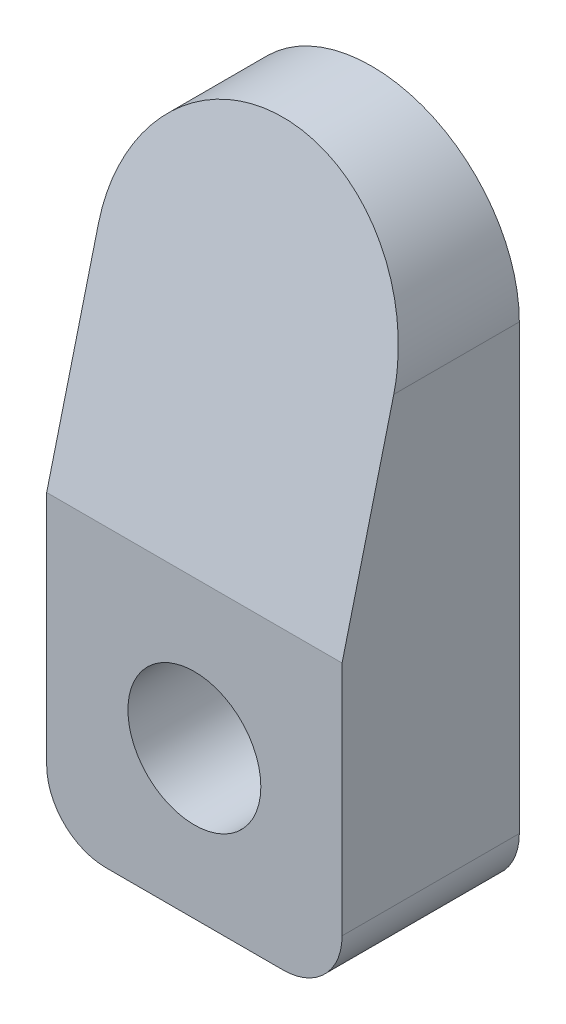
ISO-10303-21;
HEADER;
FILE_DESCRIPTION(('STEP AP214'),'2;1');
FILE_NAME('part.step','',(''),(''),'','','');
FILE_SCHEMA(('AUTOMOTIVE_DESIGN { 1 0 10303 214 1 1 1 1 }'));
ENDSEC;
DATA;
#1=APPLICATION_CONTEXT('core data for automotive mechanical design processes');
#2=APPLICATION_PROTOCOL_DEFINITION('international standard','automotive_design',2000,#1);
#3=PRODUCT_CONTEXT('',#1,'mechanical');
#4=PRODUCT('Part','Part','',(#3));
#5=PRODUCT_RELATED_PRODUCT_CATEGORY('part','',(#4));
#6=PRODUCT_DEFINITION_FORMATION('','',#4);
#7=PRODUCT_DEFINITION_CONTEXT('part definition',#1,'design');
#8=PRODUCT_DEFINITION('design','',#6,#7);
#9=PRODUCT_DEFINITION_SHAPE('','',#8);
#10=(LENGTH_UNIT() NAMED_UNIT(*) SI_UNIT(.MILLI.,.METRE.));
#11=(NAMED_UNIT(*) PLANE_ANGLE_UNIT() SI_UNIT($,.RADIAN.));
#12=(NAMED_UNIT(*) SI_UNIT($,.STERADIAN.) SOLID_ANGLE_UNIT());
#13=UNCERTAINTY_MEASURE_WITH_UNIT(LENGTH_MEASURE(1.E-05),#10,'distance_accuracy_value','');
#14=(GEOMETRIC_REPRESENTATION_CONTEXT(3) GLOBAL_UNCERTAINTY_ASSIGNED_CONTEXT((#13)) GLOBAL_UNIT_ASSIGNED_CONTEXT((#10,
#11,#12)) REPRESENTATION_CONTEXT('',''));
#15=CARTESIAN_POINT('',(0.,0.,0.));
#16=DIRECTION('',(0.,0.,1.));
#17=DIRECTION('',(1.,0.,0.));
#18=AXIS2_PLACEMENT_3D('',#15,#16,#17);
#19=CARTESIAN_POINT('',(0.,12.,6.));
#20=DIRECTION('',(0.,0.,1.));
#21=DIRECTION('',(1.,0.,0.));
#22=AXIS2_PLACEMENT_3D('',#19,#20,#21);
#23=PLANE('',#22);
#24=DIRECTION('',(0.,-1.,0.));
#25=VECTOR('',#24,1.);
#26=CARTESIAN_POINT('',(-5.00000000000001,12.,6.));
#27=LINE('',#26,#25);
#28=CARTESIAN_POINT('',(-5.00000000000001,5.,6.));
#29=VERTEX_POINT('',#28);
#30=CARTESIAN_POINT('',(-5.,-3.,6.));
#31=VERTEX_POINT('',#30);
#32=EDGE_CURVE('E105',#29,#31,#27,.T.);
#33=ORIENTED_EDGE('',*,*,#32,.T.);
#34=CARTESIAN_POINT('',(-3.,-3.,6.));
#35=DIRECTION('',(0.,0.,1.));
#36=DIRECTION('',(1.,0.,0.));
#37=AXIS2_PLACEMENT_3D('',#34,#35,#36);
#38=CIRCLE('',#37,2.);
#39=CARTESIAN_POINT('',(-3.,-5.,6.));
#40=VERTEX_POINT('',#39);
#41=EDGE_CURVE('E40',#31,#40,#38,.T.);
#42=ORIENTED_EDGE('',*,*,#41,.T.);
#43=DIRECTION('',(1.,0.,0.));
#44=VECTOR('',#43,1.);
#45=CARTESIAN_POINT('',(-5.,-5.,6.));
#46=LINE('',#45,#44);
#47=CARTESIAN_POINT('',(3.,-5.,6.));
#48=VERTEX_POINT('',#47);
#49=EDGE_CURVE('E110',#40,#48,#46,.T.);
#50=ORIENTED_EDGE('',*,*,#49,.T.);
#51=CARTESIAN_POINT('',(3.,-3.,6.));
#52=DIRECTION('',(0.,0.,1.));
#53=DIRECTION('',(1.,0.,0.));
#54=AXIS2_PLACEMENT_3D('',#51,#52,#53);
#55=CIRCLE('',#54,2.);
#56=CARTESIAN_POINT('',(5.,-3.,6.));
#57=VERTEX_POINT('',#56);
#58=EDGE_CURVE('E47',#48,#57,#55,.T.);
#59=ORIENTED_EDGE('',*,*,#58,.T.);
#60=DIRECTION('',(0.,1.,0.));
#61=VECTOR('',#60,1.);
#62=CARTESIAN_POINT('',(4.99999999999999,12.,6.));
#63=LINE('',#62,#61);
#64=CARTESIAN_POINT('',(5.,5.,6.));
#65=VERTEX_POINT('',#64);
#66=EDGE_CURVE('E107',#57,#65,#63,.T.);
#67=ORIENTED_EDGE('',*,*,#66,.T.);
#68=DIRECTION('',(1.,0.,0.));
#69=VECTOR('',#68,1.);
#70=CARTESIAN_POINT('',(-5.00000000000001,5.,6.));
#71=LINE('',#70,#69);
#72=EDGE_CURVE('E98',#29,#65,#71,.T.);
#73=ORIENTED_EDGE('',*,*,#72,.F.);
#74=EDGE_LOOP('',(#33,#42,#50,#59,#67,#73));
#75=FACE_BOUND('',#74,.T.);
#76=CARTESIAN_POINT('',(0.,0.,6.));
#77=DIRECTION('',(0.,0.,1.));
#78=DIRECTION('',(1.,0.,0.));
#79=AXIS2_PLACEMENT_3D('',#76,#77,#78);
#80=CIRCLE('',#79,2.25);
#81=CARTESIAN_POINT('',(2.25,0.,6.));
#82=VERTEX_POINT('',#81);
#83=EDGE_CURVE('E126',#82,#82,#80,.T.);
#84=ORIENTED_EDGE('',*,*,#83,.F.);
#85=EDGE_LOOP('',(#84));
#86=FACE_BOUND('',#85,.T.);
#87=ADVANCED_FACE('F32',(#75,#86),#23,.T.);
#88=CARTESIAN_POINT('',(0.,12.,0.));
#89=DIRECTION('',(0.,0.,1.));
#90=DIRECTION('',(1.,0.,0.));
#91=AXIS2_PLACEMENT_3D('',#88,#89,#90);
#92=PLANE('',#91);
#93=DIRECTION('',(1.,0.,0.));
#94=VECTOR('',#93,1.);
#95=CARTESIAN_POINT('',(-5.,-5.,0.));
#96=LINE('',#95,#94);
#97=CARTESIAN_POINT('',(-3.,-5.,0.));
#98=VERTEX_POINT('',#97);
#99=CARTESIAN_POINT('',(3.,-5.,0.));
#100=VERTEX_POINT('',#99);
#101=EDGE_CURVE('E114',#98,#100,#96,.T.);
#102=ORIENTED_EDGE('',*,*,#101,.F.);
#103=CARTESIAN_POINT('',(-3.,-3.,0.));
#104=DIRECTION('',(0.,0.,1.));
#105=DIRECTION('',(1.,0.,0.));
#106=AXIS2_PLACEMENT_3D('',#103,#104,#105);
#107=CIRCLE('',#106,2.);
#108=CARTESIAN_POINT('',(-5.,-3.,0.));
#109=VERTEX_POINT('',#108);
#110=EDGE_CURVE('E141',#98,#109,#107,.F.);
#111=ORIENTED_EDGE('',*,*,#110,.T.);
#112=DIRECTION('',(0.,-1.,0.));
#113=VECTOR('',#112,1.);
#114=CARTESIAN_POINT('',(-5.00000000000001,12.,0.));
#115=LINE('',#114,#113);
#116=CARTESIAN_POINT('',(-5.00000000000001,12.,0.));
#117=VERTEX_POINT('',#116);
#118=EDGE_CURVE('E125',#117,#109,#115,.T.);
#119=ORIENTED_EDGE('',*,*,#118,.F.);
#120=CARTESIAN_POINT('',(0.,12.,0.));
#121=DIRECTION('',(0.,0.,1.));
#122=DIRECTION('',(1.,0.,0.));
#123=AXIS2_PLACEMENT_3D('',#120,#121,#122);
#124=CIRCLE('',#123,5.);
#125=CARTESIAN_POINT('',(4.99999999999999,12.,0.));
#126=VERTEX_POINT('',#125);
#127=EDGE_CURVE('E122',#126,#117,#124,.T.);
#128=ORIENTED_EDGE('',*,*,#127,.F.);
#129=DIRECTION('',(0.,1.,0.));
#130=VECTOR('',#129,1.);
#131=CARTESIAN_POINT('',(4.99999999999999,12.,0.));
#132=LINE('',#131,#130);
#133=CARTESIAN_POINT('',(5.,-3.,0.));
#134=VERTEX_POINT('',#133);
#135=EDGE_CURVE('E111',#134,#126,#132,.T.);
#136=ORIENTED_EDGE('',*,*,#135,.F.);
#137=CARTESIAN_POINT('',(3.,-3.,0.));
#138=DIRECTION('',(0.,0.,1.));
#139=DIRECTION('',(1.,0.,0.));
#140=AXIS2_PLACEMENT_3D('',#137,#138,#139);
#141=CIRCLE('',#140,2.);
#142=EDGE_CURVE('E139',#134,#100,#141,.F.);
#143=ORIENTED_EDGE('',*,*,#142,.T.);
#144=EDGE_LOOP('',(#102,#111,#119,#128,#136,#143));
#145=FACE_BOUND('',#144,.T.);
#146=CARTESIAN_POINT('',(0.,0.,0.));
#147=DIRECTION('',(0.,0.,1.));
#148=DIRECTION('',(1.,0.,0.));
#149=AXIS2_PLACEMENT_3D('',#146,#147,#148);
#150=CIRCLE('',#149,2.25);
#151=CARTESIAN_POINT('',(2.25,0.,0.));
#152=VERTEX_POINT('',#151);
#153=EDGE_CURVE('E117',#152,#152,#150,.T.);
#154=ORIENTED_EDGE('',*,*,#153,.T.);
#155=EDGE_LOOP('',(#154));
#156=FACE_BOUND('',#155,.T.);
#157=ADVANCED_FACE('F154',(#145,#156),#92,.F.);
#158=CARTESIAN_POINT('',(0.,12.,6.));
#159=DIRECTION('',(0.,0.,-1.));
#160=DIRECTION('',(-1.,0.,0.));
#161=AXIS2_PLACEMENT_3D('',#158,#159,#160);
#162=CYLINDRICAL_SURFACE('',#161,5.);
#163=CARTESIAN_POINT('',(0.,12.,4.25));
#164=DIRECTION('',(0.,-0.242535625036333,-0.970142500145332));
#165=DIRECTION('',(0.,0.970142500145332,-0.242535625036333));
#166=AXIS2_PLACEMENT_3D('',#163,#164,#165);
#167=ELLIPSE('',#166,5.15388203202208,5.);
#168=CARTESIAN_POINT('',(-5.00000000000001,12.,4.25));
#169=VERTEX_POINT('',#168);
#170=CARTESIAN_POINT('',(4.99999999999999,12.,4.25));
#171=VERTEX_POINT('',#170);
#172=EDGE_CURVE('E100',#169,#171,#167,.T.);
#173=ORIENTED_EDGE('',*,*,#172,.T.);
#174=DIRECTION('',(0.,0.,-1.));
#175=VECTOR('',#174,1.);
#176=CARTESIAN_POINT('',(4.99999999999999,12.,6.));
#177=LINE('',#176,#175);
#178=EDGE_CURVE('E121',#171,#126,#177,.T.);
#179=ORIENTED_EDGE('',*,*,#178,.T.);
#180=ORIENTED_EDGE('',*,*,#127,.T.);
#181=DIRECTION('',(0.,0.,-1.));
#182=VECTOR('',#181,1.);
#183=CARTESIAN_POINT('',(-5.00000000000001,12.,6.));
#184=LINE('',#183,#182);
#185=EDGE_CURVE('E132',#169,#117,#184,.T.);
#186=ORIENTED_EDGE('',*,*,#185,.F.);
#187=EDGE_LOOP('',(#173,#179,#180,#186));
#188=FACE_BOUND('',#187,.T.);
#189=ADVANCED_FACE('F158',(#188),#162,.T.);
#190=CARTESIAN_POINT('',(-5.00000000000001,12.,6.));
#191=DIRECTION('',(1.,0.,0.));
#192=DIRECTION('',(0.,1.,0.));
#193=AXIS2_PLACEMENT_3D('',#190,#191,#192);
#194=PLANE('',#193);
#195=ORIENTED_EDGE('',*,*,#118,.T.);
#196=DIRECTION('',(0.,0.,-1.));
#197=VECTOR('',#196,1.);
#198=CARTESIAN_POINT('',(-5.,-3.,6.));
#199=LINE('',#198,#197);
#200=EDGE_CURVE('E55',#109,#31,#199,.F.);
#201=ORIENTED_EDGE('',*,*,#200,.T.);
#202=ORIENTED_EDGE('',*,*,#32,.F.);
#203=DIRECTION('',(0.,0.970142500145332,-0.242535625036333));
#204=VECTOR('',#203,1.);
#205=CARTESIAN_POINT('',(-5.00000000000001,5.,6.));
#206=LINE('',#205,#204);
#207=EDGE_CURVE('E94',#29,#169,#206,.T.);
#208=ORIENTED_EDGE('',*,*,#207,.T.);
#209=ORIENTED_EDGE('',*,*,#185,.T.);
#210=EDGE_LOOP('',(#195,#201,#202,#208,#209));
#211=FACE_BOUND('',#210,.T.);
#212=ADVANCED_FACE('F109',(#211),#194,.F.);
#213=CARTESIAN_POINT('',(-5.,-5.,6.));
#214=DIRECTION('',(0.,1.,0.));
#215=DIRECTION('',(0.,0.,1.));
#216=AXIS2_PLACEMENT_3D('',#213,#214,#215);
#217=PLANE('',#216);
#218=ORIENTED_EDGE('',*,*,#49,.F.);
#219=DIRECTION('',(0.,0.,-1.));
#220=VECTOR('',#219,1.);
#221=CARTESIAN_POINT('',(-3.,-5.,6.));
#222=LINE('',#221,#220);
#223=EDGE_CURVE('E136',#40,#98,#222,.T.);
#224=ORIENTED_EDGE('',*,*,#223,.T.);
#225=ORIENTED_EDGE('',*,*,#101,.T.);
#226=DIRECTION('',(0.,0.,-1.));
#227=VECTOR('',#226,1.);
#228=CARTESIAN_POINT('',(3.,-5.,6.));
#229=LINE('',#228,#227);
#230=EDGE_CURVE('E134',#100,#48,#229,.F.);
#231=ORIENTED_EDGE('',*,*,#230,.T.);
#232=EDGE_LOOP('',(#218,#224,#225,#231));
#233=FACE_BOUND('',#232,.T.);
#234=ADVANCED_FACE('F148',(#233),#217,.F.);
#235=CARTESIAN_POINT('',(4.99999999999999,12.,6.));
#236=DIRECTION('',(-1.,0.,0.));
#237=DIRECTION('',(0.,-1.,0.));
#238=AXIS2_PLACEMENT_3D('',#235,#236,#237);
#239=PLANE('',#238);
#240=ORIENTED_EDGE('',*,*,#66,.F.);
#241=DIRECTION('',(0.,0.,-1.));
#242=VECTOR('',#241,1.);
#243=CARTESIAN_POINT('',(5.,-3.,6.));
#244=LINE('',#243,#242);
#245=EDGE_CURVE('E11',#57,#134,#244,.T.);
#246=ORIENTED_EDGE('',*,*,#245,.T.);
#247=ORIENTED_EDGE('',*,*,#135,.T.);
#248=ORIENTED_EDGE('',*,*,#178,.F.);
#249=DIRECTION('',(0.,0.970142500145332,-0.242535625036333));
#250=VECTOR('',#249,1.);
#251=CARTESIAN_POINT('',(5.,5.,6.));
#252=LINE('',#251,#250);
#253=EDGE_CURVE('E102',#65,#171,#252,.T.);
#254=ORIENTED_EDGE('',*,*,#253,.F.);
#255=EDGE_LOOP('',(#240,#246,#247,#248,#254));
#256=FACE_BOUND('',#255,.T.);
#257=ADVANCED_FACE('F162',(#256),#239,.F.);
#258=CARTESIAN_POINT('',(0.,0.,6.));
#259=DIRECTION('',(0.,0.,-1.));
#260=DIRECTION('',(-1.,0.,0.));
#261=AXIS2_PLACEMENT_3D('',#258,#259,#260);
#262=CYLINDRICAL_SURFACE('',#261,2.25);
#263=ORIENTED_EDGE('',*,*,#83,.T.);
#264=EDGE_LOOP('',(#263));
#265=FACE_BOUND('',#264,.T.);
#266=ORIENTED_EDGE('',*,*,#153,.F.);
#267=EDGE_LOOP('',(#266));
#268=FACE_BOUND('',#267,.T.);
#269=ADVANCED_FACE('F176',(#265,#268),#262,.F.);
#270=CARTESIAN_POINT('',(-5.00000000000001,5.,6.));
#271=DIRECTION('',(0.,-0.242535625036333,-0.970142500145332));
#272=DIRECTION('',(0.,0.970142500145332,-0.242535625036333));
#273=AXIS2_PLACEMENT_3D('',#270,#271,#272);
#274=PLANE('',#273);
#275=ORIENTED_EDGE('',*,*,#172,.F.);
#276=ORIENTED_EDGE('',*,*,#207,.F.);
#277=ORIENTED_EDGE('',*,*,#72,.T.);
#278=ORIENTED_EDGE('',*,*,#253,.T.);
#279=EDGE_LOOP('',(#275,#276,#277,#278));
#280=FACE_BOUND('',#279,.T.);
#281=ADVANCED_FACE('F96',(#280),#274,.F.);
#282=CARTESIAN_POINT('',(-3.,-3.,6.));
#283=DIRECTION('',(0.,0.,-1.));
#284=DIRECTION('',(-1.,0.,0.));
#285=AXIS2_PLACEMENT_3D('',#282,#283,#284);
#286=CYLINDRICAL_SURFACE('',#285,2.);
#287=ORIENTED_EDGE('',*,*,#41,.F.);
#288=ORIENTED_EDGE('',*,*,#200,.F.);
#289=ORIENTED_EDGE('',*,*,#110,.F.);
#290=ORIENTED_EDGE('',*,*,#223,.F.);
#291=EDGE_LOOP('',(#287,#288,#289,#290));
#292=FACE_BOUND('',#291,.T.);
#293=ADVANCED_FACE('F151',(#292),#286,.T.);
#294=CARTESIAN_POINT('',(3.,-3.,6.));
#295=DIRECTION('',(0.,0.,-1.));
#296=DIRECTION('',(-1.,0.,0.));
#297=AXIS2_PLACEMENT_3D('',#294,#295,#296);
#298=CYLINDRICAL_SURFACE('',#297,2.);
#299=ORIENTED_EDGE('',*,*,#58,.F.);
#300=ORIENTED_EDGE('',*,*,#230,.F.);
#301=ORIENTED_EDGE('',*,*,#142,.F.);
#302=ORIENTED_EDGE('',*,*,#245,.F.);
#303=EDGE_LOOP('',(#299,#300,#301,#302));
#304=FACE_BOUND('',#303,.T.);
#305=ADVANCED_FACE('F34',(#304),#298,.T.);
#306=CLOSED_SHELL('',(#87,#157,#189,#212,#234,#257,#269,#281,#293,#305));
#307=MANIFOLD_SOLID_BREP('B2',#306);
#308=ADVANCED_BREP_SHAPE_REPRESENTATION('',(#18,#307),#14);
#309=SHAPE_DEFINITION_REPRESENTATION(#9,#308);
ENDSEC;
END-ISO-10303-21;
